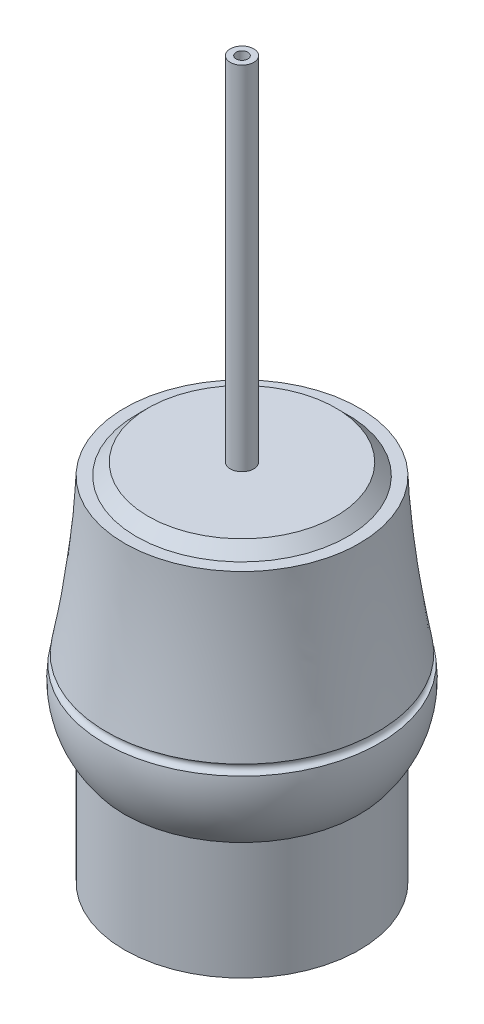
ISO-10303-21;
HEADER;
FILE_DESCRIPTION(('STEP AP214'),'2;1');
FILE_NAME('part.step','',(''),(''),'','','');
FILE_SCHEMA(('AUTOMOTIVE_DESIGN { 1 0 10303 214 1 1 1 1 }'));
ENDSEC;
DATA;
#1=APPLICATION_CONTEXT('core data for automotive mechanical design processes');
#2=APPLICATION_PROTOCOL_DEFINITION('international standard','automotive_design',2000,#1);
#3=PRODUCT_CONTEXT('',#1,'mechanical');
#4=PRODUCT('Part','Part','',(#3));
#5=PRODUCT_RELATED_PRODUCT_CATEGORY('part','',(#4));
#6=PRODUCT_DEFINITION_FORMATION('','',#4);
#7=PRODUCT_DEFINITION_CONTEXT('part definition',#1,'design');
#8=PRODUCT_DEFINITION('design','',#6,#7);
#9=PRODUCT_DEFINITION_SHAPE('','',#8);
#10=(LENGTH_UNIT() NAMED_UNIT(*) SI_UNIT(.MILLI.,.METRE.));
#11=(NAMED_UNIT(*) PLANE_ANGLE_UNIT() SI_UNIT($,.RADIAN.));
#12=(NAMED_UNIT(*) SI_UNIT($,.STERADIAN.) SOLID_ANGLE_UNIT());
#13=UNCERTAINTY_MEASURE_WITH_UNIT(LENGTH_MEASURE(1.E-05),#10,'distance_accuracy_value','');
#14=(GEOMETRIC_REPRESENTATION_CONTEXT(3) GLOBAL_UNCERTAINTY_ASSIGNED_CONTEXT((#13)) GLOBAL_UNIT_ASSIGNED_CONTEXT((#10,
#11,#12)) REPRESENTATION_CONTEXT('',''));
#15=CARTESIAN_POINT('',(0.,0.,0.));
#16=DIRECTION('',(0.,0.,1.));
#17=DIRECTION('',(1.,0.,0.));
#18=AXIS2_PLACEMENT_3D('',#15,#16,#17);
#19=CARTESIAN_POINT('',(0.,15.0188133565813,0.));
#20=DIRECTION('',(0.,1.,0.));
#21=DIRECTION('',(0.,0.,1.));
#22=AXIS2_PLACEMENT_3D('',#19,#20,#21);
#23=DEGENERATE_TOROIDAL_SURFACE('',#22,3.77011135799357,8.,.T.);
#24=CARTESIAN_POINT('',(0.,10.,0.));
#25=DIRECTION('',(0.,1.,0.));
#26=DIRECTION('',(0.,0.,1.));
#27=AXIS2_PLACEMENT_3D('',#24,#25,#26);
#28=CIRCLE('',#27,10.);
#29=CARTESIAN_POINT('',(0.,10.,10.));
#30=VERTEX_POINT('',#29);
#31=EDGE_CURVE('E46',#30,#30,#28,.T.);
#32=ORIENTED_EDGE('',*,*,#31,.T.);
#33=EDGE_LOOP('',(#32));
#34=FACE_BOUND('',#33,.T.);
#35=CARTESIAN_POINT('',(0.,16.0948033821194,0.));
#36=DIRECTION('',(0.,1.,0.));
#37=DIRECTION('',(0.,0.,1.));
#38=AXIS2_PLACEMENT_3D('',#35,#36,#37);
#39=CIRCLE('',#38,11.6974214607298);
#40=CARTESIAN_POINT('',(0.,16.0948033821194,11.6974214607298));
#41=VERTEX_POINT('',#40);
#42=EDGE_CURVE('E61',#41,#41,#39,.F.);
#43=ORIENTED_EDGE('',*,*,#42,.T.);
#44=EDGE_LOOP('',(#43));
#45=FACE_BOUND('',#44,.T.);
#46=ADVANCED_FACE('F34',(#34,#45),#23,.T.);
#47=CARTESIAN_POINT('',(0.,10.,0.));
#48=DIRECTION('',(0.,-1.,0.));
#49=DIRECTION('',(0.,0.,-1.));
#50=AXIS2_PLACEMENT_3D('',#47,#48,#49);
#51=CYLINDRICAL_SURFACE('',#50,10.);
#52=ORIENTED_EDGE('',*,*,#31,.F.);
#53=EDGE_LOOP('',(#52));
#54=FACE_BOUND('',#53,.T.);
#55=CARTESIAN_POINT('',(0.,0.,0.));
#56=DIRECTION('',(0.,1.,0.));
#57=DIRECTION('',(0.,0.,1.));
#58=AXIS2_PLACEMENT_3D('',#55,#56,#57);
#59=CIRCLE('',#58,10.);
#60=CARTESIAN_POINT('',(0.,0.,10.));
#61=VERTEX_POINT('',#60);
#62=EDGE_CURVE('E51',#61,#61,#59,.T.);
#63=ORIENTED_EDGE('',*,*,#62,.T.);
#64=EDGE_LOOP('',(#63));
#65=FACE_BOUND('',#64,.T.);
#66=ADVANCED_FACE('F144',(#54,#65),#51,.T.);
#67=CARTESIAN_POINT('',(0.,0.,0.));
#68=DIRECTION('',(0.,1.,0.));
#69=DIRECTION('',(0.,0.,1.));
#70=AXIS2_PLACEMENT_3D('',#67,#68,#69);
#71=PLANE('',#70);
#72=ORIENTED_EDGE('',*,*,#62,.F.);
#73=EDGE_LOOP('',(#72));
#74=FACE_BOUND('',#73,.T.);
#75=ADVANCED_FACE('F96',(#74),#71,.F.);
#76=CARTESIAN_POINT('',(0.,16.4897000161311,0.));
#77=DIRECTION('',(0.,-1.,0.));
#78=DIRECTION('',(0.,0.,-1.));
#79=AXIS2_PLACEMENT_3D('',#76,#77,#78);
#80=TOROIDAL_SURFACE('',#79,11.6337296367028,0.4);
#81=CARTESIAN_POINT('',(0.,16.8829935317821,0.));
#82=DIRECTION('',(0.,1.,0.));
#83=DIRECTION('',(0.,0.,1.));
#84=AXIS2_PLACEMENT_3D('',#81,#82,#83);
#85=CIRCLE('',#84,11.5607898632806);
#86=CARTESIAN_POINT('',(-11.559138394285,16.8829935317821,-0.195401752032929));
#87=VERTEX_POINT('',#86);
#88=EDGE_CURVE('E57',#87,#87,#85,.T.);
#89=ORIENTED_EDGE('',*,*,#88,.F.);
#90=EDGE_LOOP('',(#89));
#91=FACE_BOUND('',#90,.T.);
#92=ORIENTED_EDGE('',*,*,#42,.F.);
#93=EDGE_LOOP('',(#92));
#94=FACE_BOUND('',#93,.T.);
#95=ADVANCED_FACE('F85',(#91,#94),#80,.F.);
#96=CARTESIAN_POINT('',(0.,30.,0.));
#97=DIRECTION('',(0.,1.,0.));
#98=DIRECTION('',(0.,0.,1.));
#99=AXIS2_PLACEMENT_3D('',#96,#97,#98);
#100=PLANE('',#99);
#101=CARTESIAN_POINT('',(0.,30.,0.));
#102=DIRECTION('',(0.,1.,0.));
#103=DIRECTION('',(0.,0.,1.));
#104=AXIS2_PLACEMENT_3D('',#101,#102,#103);
#105=CIRCLE('',#104,9.);
#106=CARTESIAN_POINT('',(0.,30.,9.));
#107=VERTEX_POINT('',#106);
#108=EDGE_CURVE('E42',#107,#107,#105,.T.);
#109=ORIENTED_EDGE('',*,*,#108,.F.);
#110=EDGE_LOOP('',(#109));
#111=FACE_BOUND('',#110,.T.);
#112=CARTESIAN_POINT('',(0.,30.,0.));
#113=DIRECTION('',(0.,1.,0.));
#114=DIRECTION('',(0.,0.,1.));
#115=AXIS2_PLACEMENT_3D('',#112,#113,#114);
#116=CIRCLE('',#115,10.);
#117=CARTESIAN_POINT('',(-9.07958893842275,30.,-4.19059240552828));
#118=VERTEX_POINT('',#117);
#119=EDGE_CURVE('E60',#118,#118,#116,.T.);
#120=ORIENTED_EDGE('',*,*,#119,.T.);
#121=EDGE_LOOP('',(#120));
#122=FACE_BOUND('',#121,.T.);
#123=ADVANCED_FACE('F84',(#111,#122),#100,.T.);
#124=CARTESIAN_POINT('',(-12.860252555339,10.,1.90102714680719));
#125=CARTESIAN_POINT('',(-9.07958893842275,30.,-4.19059240552828));
#126=CARTESIAN_POINT('',(-9.05819826172457,10.,27.6215322574851));
#127=CARTESIAN_POINT('',(-17.4607737494793,30.,13.9685854713172));
#128=CARTESIAN_POINT('',(16.6623068489533,10.,23.8194779638707));
#129=CARTESIAN_POINT('',(0.698404127366185,30.,22.3497702823738));
#130=CARTESIAN_POINT('',(12.860252555339,10.,-1.9010271468072));
#131=CARTESIAN_POINT('',(9.07958893842275,30.,4.19059240552828));
#132=CARTESIAN_POINT('',(9.05819826172456,10.,-27.6215322574851));
#133=CARTESIAN_POINT('',(17.4607737494793,30.,-13.9685854713172));
#134=CARTESIAN_POINT('',(-16.6623068489533,10.,-23.8194779638707));
#135=CARTESIAN_POINT('',(-0.698404127366176,30.,-22.3497702823738));
#136=CARTESIAN_POINT('',(-12.860252555339,10.,1.90102714680719));
#137=CARTESIAN_POINT('',(-9.07958893842275,30.,-4.19059240552828));
#138=(BOUNDED_SURFACE() B_SPLINE_SURFACE(3,1,((#124,#125),(#126,#127),(#128,#129),(#130,#131),
(#132,#133),(#134,#135),(#136,#137)),.UNSPECIFIED.,.T.,.F.,.F.) B_SPLINE_SURFACE_WITH_KNOTS((4,
3,4),(2,2),(0.,0.5,1.),(0.,1.),
.UNSPECIFIED.) GEOMETRIC_REPRESENTATION_ITEM() RATIONAL_B_SPLINE_SURFACE(((1.,1.),
(0.333333333333333,0.333333333333334),(0.333333333333333,0.333333333333334),(1.,1.),
(0.333333333333333,0.333333333333333),(0.333333333333333,0.333333333333333),(1.,1.))) REPRESENTATION_ITEM('') SURFACE());
#139=CARTESIAN_POINT('',(-9.07958893842275,30.,-4.19059240552828));
#140=CARTESIAN_POINT('',(-9.10541757858798,29.8633645159561,-4.14897583622103));
#141=CARTESIAN_POINT('',(-9.13124621875321,29.7267290319121,-4.10735926691379));
#142=CARTESIAN_POINT('',(-9.18290349908368,29.4534580638243,-4.0241261282993));
#143=CARTESIAN_POINT('',(-9.20873213924891,29.3168225797803,-3.98250955899206));
#144=CARTESIAN_POINT('',(-9.26038941957938,29.0435516116924,-3.89927642037757));
#145=CARTESIAN_POINT('',(-9.28621805974461,28.9069161276485,-3.85765985107033));
#146=CARTESIAN_POINT('',(-9.33787534007507,28.6336451595606,-3.77442671245585));
#147=CARTESIAN_POINT('',(-9.3637039802403,28.4970096755167,-3.7328101431486));
#148=CARTESIAN_POINT('',(-9.41536126057077,28.2237387074288,-3.64957700453412));
#149=CARTESIAN_POINT('',(-9.441189900736,28.0871032233849,-3.60796043522687));
#150=CARTESIAN_POINT('',(-9.49284718106647,27.813832255297,-3.52472729661239));
#151=CARTESIAN_POINT('',(-9.5186758212317,27.6771967712531,-3.48311072730514));
#152=CARTESIAN_POINT('',(-9.57033310156216,27.4039258031652,-3.39987758869066));
#153=CARTESIAN_POINT('',(-9.59616174172739,27.2672903191213,-3.35826101938341));
#154=CARTESIAN_POINT('',(-9.64781902205786,26.9940193510334,-3.27502788076893));
#155=CARTESIAN_POINT('',(-9.67364766222309,26.8573838669895,-3.23341131146168));
#156=CARTESIAN_POINT('',(-9.72530494255355,26.5841128989016,-3.1501781728472));
#157=CARTESIAN_POINT('',(-9.75113358271879,26.4474774148577,-3.10856160353995));
#158=CARTESIAN_POINT('',(-9.80279086304925,26.1742064467698,-3.02532846492547));
#159=CARTESIAN_POINT('',(-9.82861950321448,26.0375709627258,-2.98371189561822));
#160=CARTESIAN_POINT('',(-9.88027678354495,25.764299994638,-2.90047875700374));
#161=CARTESIAN_POINT('',(-9.90610542371018,25.627664510594,-2.85886218769649));
#162=CARTESIAN_POINT('',(-9.95776270404065,25.3543935425062,-2.77562904908201));
#163=CARTESIAN_POINT('',(-9.98359134420588,25.2177580584622,-2.73401247977476));
#164=CARTESIAN_POINT('',(-10.0352486245363,24.9444870903744,-2.65077934116028));
#165=CARTESIAN_POINT('',(-10.0610772647016,24.8078516063304,-2.60916277185304));
#166=CARTESIAN_POINT('',(-10.112734545032,24.5345806382425,-2.52592963323855));
#167=CARTESIAN_POINT('',(-10.1385631851973,24.3979451541986,-2.48431306393131));
#168=CARTESIAN_POINT('',(-10.1902204655277,24.1246741861107,-2.40107992531682));
#169=CARTESIAN_POINT('',(-10.216049105693,23.9880387020668,-2.35946335600958));
#170=CARTESIAN_POINT('',(-10.2677063860234,23.7147677339789,-2.27623021739509));
#171=CARTESIAN_POINT('',(-10.2935350261887,23.578132249935,-2.23461364808785));
#172=CARTESIAN_POINT('',(-10.3451923065191,23.3048612818471,-2.15138050947336));
#173=CARTESIAN_POINT('',(-10.3710209466844,23.1682257978032,-2.10976394016612));
#174=CARTESIAN_POINT('',(-10.4226782270148,22.8949548297153,-2.02653080155163));
#175=CARTESIAN_POINT('',(-10.4485068671801,22.7583193456714,-1.98491423224439));
#176=CARTESIAN_POINT('',(-10.5001641475105,22.4850483775835,-1.9016810936299));
#177=CARTESIAN_POINT('',(-10.5259927876758,22.3484128935396,-1.86006452432266));
#178=CARTESIAN_POINT('',(-10.5776500680062,22.0751419254517,-1.77683138570817));
#179=CARTESIAN_POINT('',(-10.6034787081714,21.9385064414077,-1.73521481640093));
#180=CARTESIAN_POINT('',(-10.6551359885019,21.6652354733199,-1.65198167778644));
#181=CARTESIAN_POINT('',(-10.6809646286672,21.5285999892759,-1.6103651084792));
#182=CARTESIAN_POINT('',(-10.7326219089976,21.2553290211881,-1.52713196986471));
#183=CARTESIAN_POINT('',(-10.7584505491628,21.1186935371441,-1.48551540055747));
#184=CARTESIAN_POINT('',(-10.8101078294933,20.8454225690563,-1.40228226194298));
#185=CARTESIAN_POINT('',(-10.8359364696585,20.7087870850123,-1.36066569263574));
#186=CARTESIAN_POINT('',(-10.887593749989,20.4355161169245,-1.27743255402125));
#187=CARTESIAN_POINT('',(-10.9134223901542,20.2988806328805,-1.23581598471401));
#188=CARTESIAN_POINT('',(-10.9650796704847,20.0256096647926,-1.15258284609952));
#189=CARTESIAN_POINT('',(-10.9909083106499,19.8889741807487,-1.11096627679228));
#190=CARTESIAN_POINT('',(-11.0425655909804,19.6157032126608,-1.02773313817779));
#191=CARTESIAN_POINT('',(-11.0683942311456,19.4790677286169,-0.98611656887055));
#192=CARTESIAN_POINT('',(-11.1200515114761,19.205796760529,-0.902883430256064));
#193=CARTESIAN_POINT('',(-11.1458801516413,19.0691612764851,-0.86126686094882));
#194=CARTESIAN_POINT('',(-11.1975374319718,18.7958903083972,-0.778033722334333));
#195=CARTESIAN_POINT('',(-11.223366072137,18.6592548243533,-0.73641715302709));
#196=CARTESIAN_POINT('',(-11.2750233524675,18.3859838562654,-0.653184014412604));
#197=CARTESIAN_POINT('',(-11.3008519926327,18.2493483722215,-0.611567445105361));
#198=CARTESIAN_POINT('',(-11.3525092729632,17.9760774041336,-0.528334306490875));
#199=CARTESIAN_POINT('',(-11.3783379131284,17.8394419200897,-0.486717737183631));
#200=CARTESIAN_POINT('',(-11.4299951934589,17.5661709520018,-0.403484598569145));
#201=CARTESIAN_POINT('',(-11.4558238336241,17.4295354679579,-0.361868029261902));
#202=CARTESIAN_POINT('',(-11.5074811139546,17.15626449987,-0.278634890647416));
#203=CARTESIAN_POINT('',(-11.5333097541198,17.019629015826,-0.237018321340172));
#204=CARTESIAN_POINT('',(-11.559138394285,16.8829935317821,-0.195401752032929));
#205=B_SPLINE_CURVE_WITH_KNOTS('',3,(#139,#140,#141,#142,#143,#144,#145,#146,#147,#148,#149,
#150,#151,#152,#153,#154,#155,#156,#157,#158,#159,#160,#161,#162,#163,#164,#165,#166,#167,#168,
#169,#170,#171,#172,#173,#174,#175,#176,#177,#178,#179,#180,#181,#182,#183,#184,#185,#186,#187,
#188,#189,#190,#191,#192,#193,#194,#195,#196,#197,#198,#199,#200,#201,#202,#203,#204),
.UNSPECIFIED.,.F.,.F.,(4,2,2,2,2,2,2,2,2,2,2,2,2,2,2,2,2,2,2,2,2,2,2,2,2,2,2,2,2,2,2,2,4),(0.,
0.435447834926865,0.870895669853729,1.30634350478059,1.74179133970746,2.17723917463432,
2.61268700956119,3.04813484448805,3.48358267941491,3.91903051434178,4.35447834926865,
4.78992618419551,5.22537401912238,5.66082185404924,6.0962696889761,6.53171752390297,
6.96716535882983,7.4026131937567,7.83806102868356,8.27350886361043,8.70895669853729,
9.14440453346415,9.57985236839102,10.0153002033179,10.4507480382448,10.8861958731716,
11.3216437080985,11.7570915430253,12.1925393779522,12.6279872128791,13.0634350478059,
13.4988828827328,13.9343307176597),.UNSPECIFIED.);
#206=EDGE_CURVE('BSEAM71',#118,#87,#205,.T.);
#207=ORIENTED_EDGE('',*,*,#119,.F.);
#208=ORIENTED_EDGE('',*,*,#88,.T.);
#209=ORIENTED_EDGE('',*,*,#206,.T.);
#210=ORIENTED_EDGE('',*,*,#206,.F.);
#211=EDGE_LOOP('',(#207,#209,#208,#210));
#212=FACE_BOUND('',#211,.T.);
#213=ADVANCED_FACE('F71',(#212),#138,.T.);
#214=CARTESIAN_POINT('',(0.,31.,0.));
#215=DIRECTION('',(0.,1.,0.));
#216=DIRECTION('',(0.,0.,1.));
#217=AXIS2_PLACEMENT_3D('',#214,#215,#216);
#218=PLANE('',#217);
#219=CARTESIAN_POINT('',(0.,31.,0.));
#220=DIRECTION('',(0.,1.,0.));
#221=DIRECTION('',(0.,0.,1.));
#222=AXIS2_PLACEMENT_3D('',#219,#220,#221);
#223=CIRCLE('',#222,1.);
#224=CARTESIAN_POINT('',(0.,31.,1.));
#225=VERTEX_POINT('',#224);
#226=EDGE_CURVE('E55',#225,#225,#223,.T.);
#227=ORIENTED_EDGE('',*,*,#226,.F.);
#228=EDGE_LOOP('',(#227));
#229=FACE_BOUND('',#228,.T.);
#230=CARTESIAN_POINT('',(0.,31.,0.));
#231=DIRECTION('',(0.,1.,0.));
#232=DIRECTION('',(0.,0.,1.));
#233=AXIS2_PLACEMENT_3D('',#230,#231,#232);
#234=CIRCLE('',#233,7.99999999999999);
#235=CARTESIAN_POINT('',(0.,31.,7.99999999999999));
#236=VERTEX_POINT('',#235);
#237=EDGE_CURVE('E11',#236,#236,#234,.T.);
#238=ORIENTED_EDGE('',*,*,#237,.T.);
#239=EDGE_LOOP('',(#238));
#240=FACE_BOUND('',#239,.T.);
#241=ADVANCED_FACE('F83',(#229,#240),#218,.T.);
#242=CARTESIAN_POINT('',(0.,31.,0.));
#243=DIRECTION('',(0.,-1.,0.));
#244=DIRECTION('',(0.,0.,-1.));
#245=AXIS2_PLACEMENT_3D('',#242,#243,#244);
#246=CONICAL_SURFACE('',#245,7.99999999999999,0.78539816339745);
#247=ORIENTED_EDGE('',*,*,#108,.T.);
#248=EDGE_LOOP('',(#247));
#249=FACE_BOUND('',#248,.T.);
#250=ORIENTED_EDGE('',*,*,#237,.F.);
#251=EDGE_LOOP('',(#250));
#252=FACE_BOUND('',#251,.T.);
#253=ADVANCED_FACE('F37',(#249,#252),#246,.T.);
#254=CARTESIAN_POINT('',(0.,61.,0.));
#255=DIRECTION('',(0.,-1.,0.));
#256=DIRECTION('',(0.,0.,-1.));
#257=AXIS2_PLACEMENT_3D('',#254,#255,#256);
#258=CYLINDRICAL_SURFACE('',#257,1.);
#259=CARTESIAN_POINT('',(0.,61.,0.));
#260=DIRECTION('',(0.,1.,0.));
#261=DIRECTION('',(0.,0.,1.));
#262=AXIS2_PLACEMENT_3D('',#259,#260,#261);
#263=CIRCLE('',#262,1.);
#264=CARTESIAN_POINT('',(0.,61.,1.));
#265=VERTEX_POINT('',#264);
#266=EDGE_CURVE('E111',#265,#265,#263,.T.);
#267=ORIENTED_EDGE('',*,*,#266,.F.);
#268=EDGE_LOOP('',(#267));
#269=FACE_BOUND('',#268,.T.);
#270=ORIENTED_EDGE('',*,*,#226,.T.);
#271=EDGE_LOOP('',(#270));
#272=FACE_BOUND('',#271,.T.);
#273=ADVANCED_FACE('F136',(#269,#272),#258,.T.);
#274=CARTESIAN_POINT('',(0.,61.,0.));
#275=DIRECTION('',(0.,1.,0.));
#276=DIRECTION('',(0.,0.,1.));
#277=AXIS2_PLACEMENT_3D('',#274,#275,#276);
#278=PLANE('',#277);
#279=CARTESIAN_POINT('',(0.,61.,0.));
#280=DIRECTION('',(0.,1.,0.));
#281=DIRECTION('',(0.,0.,1.));
#282=AXIS2_PLACEMENT_3D('',#279,#280,#281);
#283=CIRCLE('',#282,0.5);
#284=CARTESIAN_POINT('',(0.,61.,0.5));
#285=VERTEX_POINT('',#284);
#286=EDGE_CURVE('E120',#285,#285,#283,.T.);
#287=ORIENTED_EDGE('',*,*,#286,.F.);
#288=EDGE_LOOP('',(#287));
#289=FACE_BOUND('',#288,.T.);
#290=ORIENTED_EDGE('',*,*,#266,.T.);
#291=EDGE_LOOP('',(#290));
#292=FACE_BOUND('',#291,.T.);
#293=ADVANCED_FACE('F131',(#289,#292),#278,.T.);
#294=CARTESIAN_POINT('',(0.,60.,0.));
#295=DIRECTION('',(0.,1.,0.));
#296=DIRECTION('',(0.,0.,1.));
#297=AXIS2_PLACEMENT_3D('',#294,#295,#296);
#298=CYLINDRICAL_SURFACE('',#297,0.5);
#299=CARTESIAN_POINT('',(0.,60.,0.));
#300=DIRECTION('',(0.,1.,0.));
#301=DIRECTION('',(0.,0.,1.));
#302=AXIS2_PLACEMENT_3D('',#299,#300,#301);
#303=CIRCLE('',#302,0.5);
#304=CARTESIAN_POINT('',(0.,60.,0.5));
#305=VERTEX_POINT('',#304);
#306=EDGE_CURVE('E118',#305,#305,#303,.T.);
#307=ORIENTED_EDGE('',*,*,#306,.F.);
#308=EDGE_LOOP('',(#307));
#309=FACE_BOUND('',#308,.T.);
#310=ORIENTED_EDGE('',*,*,#286,.T.);
#311=EDGE_LOOP('',(#310));
#312=FACE_BOUND('',#311,.T.);
#313=ADVANCED_FACE('F128',(#309,#312),#298,.F.);
#314=CARTESIAN_POINT('',(0.,60.,0.));
#315=DIRECTION('',(0.,1.,0.));
#316=DIRECTION('',(0.,0.,1.));
#317=AXIS2_PLACEMENT_3D('',#314,#315,#316);
#318=PLANE('',#317);
#319=ORIENTED_EDGE('',*,*,#306,.T.);
#320=EDGE_LOOP('',(#319));
#321=FACE_BOUND('',#320,.T.);
#322=ADVANCED_FACE('F126',(#321),#318,.T.);
#323=CLOSED_SHELL('',(#46,#66,#75,#95,#123,#213,#241,#253,#273,#293,#313,#322));
#324=MANIFOLD_SOLID_BREP('B2',#323);
#325=ADVANCED_BREP_SHAPE_REPRESENTATION('',(#18,#324),#14);
#326=SHAPE_DEFINITION_REPRESENTATION(#9,#325);
ENDSEC;
END-ISO-10303-21;
